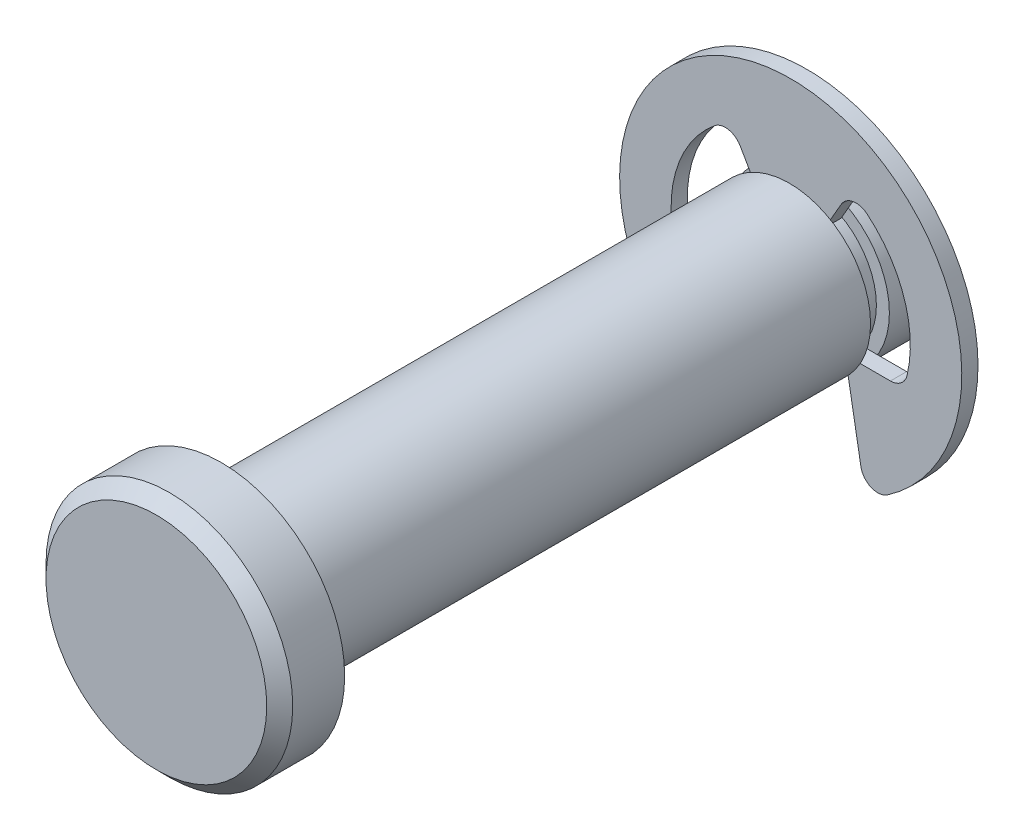
ISO-10303-21;
HEADER;
FILE_DESCRIPTION(('STEP AP214'),'2;1');
FILE_NAME('part.step','',(''),(''),'','','');
FILE_SCHEMA(('AUTOMOTIVE_DESIGN { 1 0 10303 214 1 1 1 1 }'));
ENDSEC;
DATA;
#1=APPLICATION_CONTEXT('core data for automotive mechanical design processes');
#2=APPLICATION_PROTOCOL_DEFINITION('international standard','automotive_design',2000,#1);
#3=PRODUCT_CONTEXT('',#1,'mechanical');
#4=PRODUCT('Part','Part','',(#3));
#5=PRODUCT_RELATED_PRODUCT_CATEGORY('part','',(#4));
#6=PRODUCT_DEFINITION_FORMATION('','',#4);
#7=PRODUCT_DEFINITION_CONTEXT('part definition',#1,'design');
#8=PRODUCT_DEFINITION('design','',#6,#7);
#9=PRODUCT_DEFINITION_SHAPE('','',#8);
#10=(LENGTH_UNIT() NAMED_UNIT(*) SI_UNIT(.MILLI.,.METRE.));
#11=(NAMED_UNIT(*) PLANE_ANGLE_UNIT() SI_UNIT($,.RADIAN.));
#12=(NAMED_UNIT(*) SI_UNIT($,.STERADIAN.) SOLID_ANGLE_UNIT());
#13=UNCERTAINTY_MEASURE_WITH_UNIT(LENGTH_MEASURE(1.E-05),#10,'distance_accuracy_value','');
#14=(GEOMETRIC_REPRESENTATION_CONTEXT(3) GLOBAL_UNCERTAINTY_ASSIGNED_CONTEXT((#13)) GLOBAL_UNIT_ASSIGNED_CONTEXT((#10,
#11,#12)) REPRESENTATION_CONTEXT('',''));
#15=CARTESIAN_POINT('',(0.,0.,0.));
#16=DIRECTION('',(0.,0.,1.));
#17=DIRECTION('',(1.,0.,0.));
#18=AXIS2_PLACEMENT_3D('',#15,#16,#17);
#19=CARTESIAN_POINT('',(0.,0.,-9.5758));
#20=DIRECTION('',(0.,0.,1.));
#21=DIRECTION('',(1.,0.,0.));
#22=AXIS2_PLACEMENT_3D('',#19,#20,#21);
#23=PLANE('',#22);
#24=DIRECTION('',(-0.173648177666931,0.984807753012208,0.));
#25=VECTOR('',#24,1.);
#26=CARTESIAN_POINT('',(1.79561377117954,0.316615154790629,-9.5758));
#27=LINE('',#26,#25);
#28=CARTESIAN_POINT('',(2.74784570227755,-5.08376048410501,-9.5758));
#29=VERTEX_POINT('',#28);
#30=CARTESIAN_POINT('',(2.1336,-1.6002,-9.5758));
#31=VERTEX_POINT('',#30);
#32=EDGE_CURVE('E204',#29,#31,#27,.T.);
#33=ORIENTED_EDGE('',*,*,#32,.F.);
#34=CARTESIAN_POINT('',(3.4069676832911,-4.96753949527431,-9.5758));
#35=DIRECTION('',(0.,0.,1.));
#36=DIRECTION('',(1.,0.,0.));
#37=AXIS2_PLACEMENT_3D('',#34,#35,#36);
#38=CIRCLE('',#37,0.66929);
#39=CARTESIAN_POINT('',(3.78551964810122,-5.51948832808256,-9.5758));
#40=VERTEX_POINT('',#39);
#41=EDGE_CURVE('E260',#29,#40,#38,.T.);
#42=ORIENTED_EDGE('',*,*,#41,.T.);
#43=CARTESIAN_POINT('',(0.,0.,-9.5758));
#44=DIRECTION('',(0.,0.,1.));
#45=DIRECTION('',(1.,0.,0.));
#46=AXIS2_PLACEMENT_3D('',#43,#44,#45);
#47=CIRCLE('',#46,6.6929);
#48=CARTESIAN_POINT('',(-3.78551964810122,-5.51948832808256,-9.5758));
#49=VERTEX_POINT('',#48);
#50=EDGE_CURVE('E184',#40,#49,#47,.T.);
#51=ORIENTED_EDGE('',*,*,#50,.T.);
#52=CARTESIAN_POINT('',(-3.4069676832911,-4.96753949527431,-9.5758));
#53=DIRECTION('',(0.,0.,1.));
#54=DIRECTION('',(1.,0.,0.));
#55=AXIS2_PLACEMENT_3D('',#52,#53,#54);
#56=CIRCLE('',#55,0.66929);
#57=CARTESIAN_POINT('',(-2.74784570227755,-5.08376048410501,-9.5758));
#58=VERTEX_POINT('',#57);
#59=EDGE_CURVE('E258',#49,#58,#56,.T.);
#60=ORIENTED_EDGE('',*,*,#59,.T.);
#61=DIRECTION('',(-0.173648177666931,-0.984807753012208,0.));
#62=VECTOR('',#61,1.);
#63=CARTESIAN_POINT('',(-1.79561377117954,0.316615154790629,-9.5758));
#64=LINE('',#63,#62);
#65=CARTESIAN_POINT('',(-2.1336,-1.6002,-9.5758));
#66=VERTEX_POINT('',#65);
#67=EDGE_CURVE('E200',#66,#58,#64,.T.);
#68=ORIENTED_EDGE('',*,*,#67,.F.);
#69=DIRECTION('',(1.,0.,0.));
#70=VECTOR('',#69,1.);
#71=CARTESIAN_POINT('',(0.,-1.6002,-9.5758));
#72=LINE('',#71,#70);
#73=CARTESIAN_POINT('',(-3.90112806858478,-1.6002,-9.5758));
#74=VERTEX_POINT('',#73);
#75=EDGE_CURVE('E191',#74,#66,#72,.T.);
#76=ORIENTED_EDGE('',*,*,#75,.F.);
#77=CARTESIAN_POINT('',(-3.90112806858478,-0.93091,-9.5758));
#78=DIRECTION('',(0.,0.,1.));
#79=DIRECTION('',(1.,0.,0.));
#80=AXIS2_PLACEMENT_3D('',#77,#78,#79);
#81=CIRCLE('',#80,0.66929);
#82=CARTESIAN_POINT('',(-4.55213962404525,-1.08625818556048,-9.5758));
#83=VERTEX_POINT('',#82);
#84=EDGE_CURVE('E56',#74,#83,#81,.F.);
#85=ORIENTED_EDGE('',*,*,#84,.T.);
#86=CARTESIAN_POINT('',(0.,0.,-9.5758));
#87=DIRECTION('',(0.,0.,1.));
#88=DIRECTION('',(1.,0.,0.));
#89=AXIS2_PLACEMENT_3D('',#86,#87,#88);
#90=CIRCLE('',#89,4.67995);
#91=CARTESIAN_POINT('',(-2.98351110662977,3.60563357527034,-9.5758));
#92=VERTEX_POINT('',#91);
#93=EDGE_CURVE('E216',#92,#83,#90,.T.);
#94=ORIENTED_EDGE('',*,*,#93,.F.);
#95=CARTESIAN_POINT('',(-2.55683258473184,3.08998394320319,-9.5758));
#96=DIRECTION('',(0.,0.,1.));
#97=DIRECTION('',(1.,0.,0.));
#98=AXIS2_PLACEMENT_3D('',#95,#96,#97);
#99=CIRCLE('',#98,0.66929);
#100=CARTESIAN_POINT('',(-1.97721044223295,3.42462894320319,-9.5758));
#101=VERTEX_POINT('',#100);
#102=EDGE_CURVE('E188',#92,#101,#99,.F.);
#103=ORIENTED_EDGE('',*,*,#102,.T.);
#104=DIRECTION('',(-0.500000000000001,0.866025403784438,0.));
#105=VECTOR('',#104,1.);
#106=CARTESIAN_POINT('',(0.,0.,-9.5758));
#107=LINE('',#106,#105);
#108=CARTESIAN_POINT('',(-1.3335,2.30968975189309,-9.5758));
#109=VERTEX_POINT('',#108);
#110=EDGE_CURVE('E180',#109,#101,#107,.T.);
#111=ORIENTED_EDGE('',*,*,#110,.F.);
#112=DIRECTION('',(1.,0.,0.));
#113=VECTOR('',#112,1.);
#114=CARTESIAN_POINT('',(-1.3335,2.30968975189309,-9.5758));
#115=LINE('',#114,#113);
#116=CARTESIAN_POINT('',(1.3335,2.30968975189309,-9.5758));
#117=VERTEX_POINT('',#116);
#118=EDGE_CURVE('E164',#109,#117,#115,.T.);
#119=ORIENTED_EDGE('',*,*,#118,.T.);
#120=DIRECTION('',(-0.500000000000001,-0.866025403784438,0.));
#121=VECTOR('',#120,1.);
#122=CARTESIAN_POINT('',(0.,0.,-9.5758));
#123=LINE('',#122,#121);
#124=CARTESIAN_POINT('',(1.97721044223295,3.42462894320319,-9.5758));
#125=VERTEX_POINT('',#124);
#126=EDGE_CURVE('E214',#125,#117,#123,.T.);
#127=ORIENTED_EDGE('',*,*,#126,.F.);
#128=CARTESIAN_POINT('',(2.55683258473184,3.08998394320319,-9.5758));
#129=DIRECTION('',(0.,0.,1.));
#130=DIRECTION('',(1.,0.,0.));
#131=AXIS2_PLACEMENT_3D('',#128,#129,#130);
#132=CIRCLE('',#131,0.66929);
#133=CARTESIAN_POINT('',(2.98351110662977,3.60563357527034,-9.5758));
#134=VERTEX_POINT('',#133);
#135=EDGE_CURVE('E275',#125,#134,#132,.F.);
#136=ORIENTED_EDGE('',*,*,#135,.T.);
#137=CARTESIAN_POINT('',(0.,0.,-9.5758));
#138=DIRECTION('',(0.,0.,1.));
#139=DIRECTION('',(1.,0.,0.));
#140=AXIS2_PLACEMENT_3D('',#137,#138,#139);
#141=CIRCLE('',#140,4.67995);
#142=CARTESIAN_POINT('',(4.55213962404525,-1.08625818556048,-9.5758));
#143=VERTEX_POINT('',#142);
#144=EDGE_CURVE('E219',#143,#134,#141,.T.);
#145=ORIENTED_EDGE('',*,*,#144,.F.);
#146=CARTESIAN_POINT('',(3.90112806858478,-0.93091,-9.5758));
#147=DIRECTION('',(0.,0.,1.));
#148=DIRECTION('',(1.,0.,0.));
#149=AXIS2_PLACEMENT_3D('',#146,#147,#148);
#150=CIRCLE('',#149,0.66929);
#151=CARTESIAN_POINT('',(3.90112806858478,-1.6002,-9.5758));
#152=VERTEX_POINT('',#151);
#153=EDGE_CURVE('E271',#143,#152,#150,.F.);
#154=ORIENTED_EDGE('',*,*,#153,.T.);
#155=DIRECTION('',(1.,0.,0.));
#156=VECTOR('',#155,1.);
#157=CARTESIAN_POINT('',(0.,-1.6002,-9.5758));
#158=LINE('',#157,#156);
#159=EDGE_CURVE('E209',#31,#152,#158,.T.);
#160=ORIENTED_EDGE('',*,*,#159,.F.);
#161=EDGE_LOOP('',(#33,#42,#51,#60,#68,#76,#85,#94,#103,#111,#119,#127,#136,#145,#154,#160));
#162=FACE_BOUND('',#161,.T.);
#163=ADVANCED_FACE('F48',(#162),#23,.T.);
#164=CARTESIAN_POINT('',(0.,0.,-10.2108));
#165=DIRECTION('',(0.,0.,1.));
#166=DIRECTION('',(1.,0.,0.));
#167=AXIS2_PLACEMENT_3D('',#164,#165,#166);
#168=PLANE('',#167);
#169=CARTESIAN_POINT('',(0.,0.,-10.2108));
#170=DIRECTION('',(0.,0.,1.));
#171=DIRECTION('',(1.,0.,0.));
#172=AXIS2_PLACEMENT_3D('',#169,#170,#171);
#173=CIRCLE('',#172,6.6929);
#174=CARTESIAN_POINT('',(3.78551964810122,-5.51948832808256,-10.2108));
#175=VERTEX_POINT('',#174);
#176=CARTESIAN_POINT('',(-3.78551964810122,-5.51948832808256,-10.2108));
#177=VERTEX_POINT('',#176);
#178=EDGE_CURVE('E222',#175,#177,#173,.T.);
#179=ORIENTED_EDGE('',*,*,#178,.F.);
#180=CARTESIAN_POINT('',(3.4069676832911,-4.96753949527431,-10.2108));
#181=DIRECTION('',(0.,0.,1.));
#182=DIRECTION('',(1.,0.,0.));
#183=AXIS2_PLACEMENT_3D('',#180,#181,#182);
#184=CIRCLE('',#183,0.66929);
#185=CARTESIAN_POINT('',(2.74784570227755,-5.08376048410501,-10.2108));
#186=VERTEX_POINT('',#185);
#187=EDGE_CURVE('E268',#175,#186,#184,.F.);
#188=ORIENTED_EDGE('',*,*,#187,.T.);
#189=DIRECTION('',(-0.173648177666931,0.984807753012208,0.));
#190=VECTOR('',#189,1.);
#191=CARTESIAN_POINT('',(1.79561377117954,0.316615154790629,-10.2108));
#192=LINE('',#191,#190);
#193=CARTESIAN_POINT('',(2.1336,-1.6002,-10.2108));
#194=VERTEX_POINT('',#193);
#195=EDGE_CURVE('E202',#186,#194,#192,.T.);
#196=ORIENTED_EDGE('',*,*,#195,.T.);
#197=DIRECTION('',(1.,0.,0.));
#198=VECTOR('',#197,1.);
#199=CARTESIAN_POINT('',(0.,-1.6002,-10.2108));
#200=LINE('',#199,#198);
#201=CARTESIAN_POINT('',(3.90112806858478,-1.6002,-10.2108));
#202=VERTEX_POINT('',#201);
#203=EDGE_CURVE('E206',#194,#202,#200,.T.);
#204=ORIENTED_EDGE('',*,*,#203,.T.);
#205=CARTESIAN_POINT('',(3.90112806858478,-0.93091,-10.2108));
#206=DIRECTION('',(0.,0.,1.));
#207=DIRECTION('',(1.,0.,0.));
#208=AXIS2_PLACEMENT_3D('',#205,#206,#207);
#209=CIRCLE('',#208,0.66929);
#210=CARTESIAN_POINT('',(4.55213962404525,-1.08625818556048,-10.2108));
#211=VERTEX_POINT('',#210);
#212=EDGE_CURVE('E273',#202,#211,#209,.T.);
#213=ORIENTED_EDGE('',*,*,#212,.T.);
#214=CARTESIAN_POINT('',(0.,0.,-10.2108));
#215=DIRECTION('',(0.,0.,1.));
#216=DIRECTION('',(1.,0.,0.));
#217=AXIS2_PLACEMENT_3D('',#214,#215,#216);
#218=CIRCLE('',#217,4.67995);
#219=CARTESIAN_POINT('',(2.98351110662977,3.60563357527034,-10.2108));
#220=VERTEX_POINT('',#219);
#221=EDGE_CURVE('E232',#211,#220,#218,.T.);
#222=ORIENTED_EDGE('',*,*,#221,.T.);
#223=CARTESIAN_POINT('',(2.55683258473184,3.08998394320319,-10.2108));
#224=DIRECTION('',(0.,0.,1.));
#225=DIRECTION('',(1.,0.,0.));
#226=AXIS2_PLACEMENT_3D('',#223,#224,#225);
#227=CIRCLE('',#226,0.66929);
#228=CARTESIAN_POINT('',(1.97721044223295,3.42462894320319,-10.2108));
#229=VERTEX_POINT('',#228);
#230=EDGE_CURVE('E277',#220,#229,#227,.T.);
#231=ORIENTED_EDGE('',*,*,#230,.T.);
#232=DIRECTION('',(-0.500000000000001,-0.866025403784438,0.));
#233=VECTOR('',#232,1.);
#234=CARTESIAN_POINT('',(0.,0.,-10.2108));
#235=LINE('',#234,#233);
#236=CARTESIAN_POINT('',(1.3335,2.30968975189309,-10.2108));
#237=VERTEX_POINT('',#236);
#238=EDGE_CURVE('E212',#229,#237,#235,.T.);
#239=ORIENTED_EDGE('',*,*,#238,.T.);
#240=DIRECTION('',(-1.,0.,0.));
#241=VECTOR('',#240,1.);
#242=CARTESIAN_POINT('',(-1.3335,2.30968975189309,-10.2108));
#243=LINE('',#242,#241);
#244=CARTESIAN_POINT('',(-1.3335,2.30968975189309,-10.2108));
#245=VERTEX_POINT('',#244);
#246=EDGE_CURVE('E175',#237,#245,#243,.T.);
#247=ORIENTED_EDGE('',*,*,#246,.T.);
#248=DIRECTION('',(-0.500000000000001,0.866025403784438,0.));
#249=VECTOR('',#248,1.);
#250=CARTESIAN_POINT('',(0.,0.,-10.2108));
#251=LINE('',#250,#249);
#252=CARTESIAN_POINT('',(-1.97721044223295,3.42462894320319,-10.2108));
#253=VERTEX_POINT('',#252);
#254=EDGE_CURVE('E183',#245,#253,#251,.T.);
#255=ORIENTED_EDGE('',*,*,#254,.T.);
#256=CARTESIAN_POINT('',(-2.55683258473184,3.08998394320319,-10.2108));
#257=DIRECTION('',(0.,0.,1.));
#258=DIRECTION('',(1.,0.,0.));
#259=AXIS2_PLACEMENT_3D('',#256,#257,#258);
#260=CIRCLE('',#259,0.66929);
#261=CARTESIAN_POINT('',(-2.98351110662977,3.60563357527034,-10.2108));
#262=VERTEX_POINT('',#261);
#263=EDGE_CURVE('E280',#253,#262,#260,.T.);
#264=ORIENTED_EDGE('',*,*,#263,.T.);
#265=CARTESIAN_POINT('',(0.,0.,-10.2108));
#266=DIRECTION('',(0.,0.,1.));
#267=DIRECTION('',(1.,0.,0.));
#268=AXIS2_PLACEMENT_3D('',#265,#266,#267);
#269=CIRCLE('',#268,4.67995);
#270=CARTESIAN_POINT('',(-4.55213962404525,-1.08625818556048,-10.2108));
#271=VERTEX_POINT('',#270);
#272=EDGE_CURVE('E229',#262,#271,#269,.T.);
#273=ORIENTED_EDGE('',*,*,#272,.T.);
#274=CARTESIAN_POINT('',(-3.90112806858478,-0.93091,-10.2108));
#275=DIRECTION('',(0.,0.,1.));
#276=DIRECTION('',(1.,0.,0.));
#277=AXIS2_PLACEMENT_3D('',#274,#275,#276);
#278=CIRCLE('',#277,0.66929);
#279=CARTESIAN_POINT('',(-3.90112806858478,-1.6002,-10.2108));
#280=VERTEX_POINT('',#279);
#281=EDGE_CURVE('E13',#271,#280,#278,.T.);
#282=ORIENTED_EDGE('',*,*,#281,.T.);
#283=DIRECTION('',(1.,0.,0.));
#284=VECTOR('',#283,1.);
#285=CARTESIAN_POINT('',(0.,-1.6002,-10.2108));
#286=LINE('',#285,#284);
#287=CARTESIAN_POINT('',(-2.1336,-1.6002,-10.2108));
#288=VERTEX_POINT('',#287);
#289=EDGE_CURVE('E189',#280,#288,#286,.T.);
#290=ORIENTED_EDGE('',*,*,#289,.T.);
#291=DIRECTION('',(-0.173648177666931,-0.984807753012208,0.));
#292=VECTOR('',#291,1.);
#293=CARTESIAN_POINT('',(-1.79561377117954,0.316615154790629,-10.2108));
#294=LINE('',#293,#292);
#295=CARTESIAN_POINT('',(-2.74784570227755,-5.08376048410501,-10.2108));
#296=VERTEX_POINT('',#295);
#297=EDGE_CURVE('E198',#288,#296,#294,.T.);
#298=ORIENTED_EDGE('',*,*,#297,.T.);
#299=CARTESIAN_POINT('',(-3.4069676832911,-4.96753949527431,-10.2108));
#300=DIRECTION('',(0.,0.,1.));
#301=DIRECTION('',(1.,0.,0.));
#302=AXIS2_PLACEMENT_3D('',#299,#300,#301);
#303=CIRCLE('',#302,0.66929);
#304=EDGE_CURVE('E70',#296,#177,#303,.F.);
#305=ORIENTED_EDGE('',*,*,#304,.T.);
#306=EDGE_LOOP('',(#179,#188,#196,#204,#213,#222,#231,#239,#247,#255,#264,#273,#282,#290,#298,#305));
#307=FACE_BOUND('',#306,.T.);
#308=ADVANCED_FACE('F293',(#307),#168,.F.);
#309=CARTESIAN_POINT('',(0.,0.,-9.5758));
#310=DIRECTION('',(0.,0.,-1.));
#311=DIRECTION('',(-1.,0.,0.));
#312=AXIS2_PLACEMENT_3D('',#309,#310,#311);
#313=CYLINDRICAL_SURFACE('',#312,6.6929);
#314=ORIENTED_EDGE('',*,*,#50,.F.);
#315=DIRECTION('',(0.,0.,-1.));
#316=VECTOR('',#315,1.);
#317=CARTESIAN_POINT('',(3.78551964810122,-5.51948832808256,-9.5758));
#318=LINE('',#317,#316);
#319=EDGE_CURVE('E265',#40,#175,#318,.T.);
#320=ORIENTED_EDGE('',*,*,#319,.T.);
#321=ORIENTED_EDGE('',*,*,#178,.T.);
#322=DIRECTION('',(0.,0.,-1.));
#323=VECTOR('',#322,1.);
#324=CARTESIAN_POINT('',(-3.78551964810122,-5.51948832808256,-9.5758));
#325=LINE('',#324,#323);
#326=EDGE_CURVE('E262',#177,#49,#325,.F.);
#327=ORIENTED_EDGE('',*,*,#326,.T.);
#328=EDGE_LOOP('',(#314,#320,#321,#327));
#329=FACE_BOUND('',#328,.T.);
#330=ADVANCED_FACE('F333',(#329),#313,.T.);
#331=CARTESIAN_POINT('',(-2.1336,-1.6002,-12.7));
#332=DIRECTION('',(-0.984807753012208,0.173648177666931,0.));
#333=DIRECTION('',(-0.173648177666931,-0.984807753012208,0.));
#334=AXIS2_PLACEMENT_3D('',#331,#332,#333);
#335=PLANE('',#334);
#336=ORIENTED_EDGE('',*,*,#67,.T.);
#337=DIRECTION('',(0.,0.,-1.));
#338=VECTOR('',#337,1.);
#339=CARTESIAN_POINT('',(-2.74784570227755,-5.08376048410501,-12.7));
#340=LINE('',#339,#338);
#341=EDGE_CURVE('E63',#58,#296,#340,.T.);
#342=ORIENTED_EDGE('',*,*,#341,.T.);
#343=ORIENTED_EDGE('',*,*,#297,.F.);
#344=DIRECTION('',(0.,0.,1.));
#345=VECTOR('',#344,1.);
#346=CARTESIAN_POINT('',(-2.1336,-1.6002,-12.7));
#347=LINE('',#346,#345);
#348=EDGE_CURVE('E298',#288,#66,#347,.T.);
#349=ORIENTED_EDGE('',*,*,#348,.T.);
#350=EDGE_LOOP('',(#336,#342,#343,#349));
#351=FACE_BOUND('',#350,.T.);
#352=ADVANCED_FACE('F338',(#351),#335,.F.);
#353=CARTESIAN_POINT('',(-2.33997500000001,4.05295558844098,-12.7));
#354=DIRECTION('',(0.866025403784438,0.500000000000001,0.));
#355=DIRECTION('',(-0.500000000000001,0.866025403784438,0.));
#356=AXIS2_PLACEMENT_3D('',#353,#354,#355);
#357=PLANE('',#356);
#358=ORIENTED_EDGE('',*,*,#110,.T.);
#359=DIRECTION('',(0.,0.,-1.));
#360=VECTOR('',#359,1.);
#361=CARTESIAN_POINT('',(-1.97721044223295,3.42462894320319,-10.2108));
#362=LINE('',#361,#360);
#363=EDGE_CURVE('E250',#101,#253,#362,.T.);
#364=ORIENTED_EDGE('',*,*,#363,.T.);
#365=ORIENTED_EDGE('',*,*,#254,.F.);
#366=DIRECTION('',(0.,0.,-1.));
#367=VECTOR('',#366,1.);
#368=CARTESIAN_POINT('',(-1.3335,2.30968975189309,-9.5758));
#369=LINE('',#368,#367);
#370=EDGE_CURVE('E168',#245,#109,#369,.F.);
#371=ORIENTED_EDGE('',*,*,#370,.T.);
#372=EDGE_LOOP('',(#358,#364,#365,#371));
#373=FACE_BOUND('',#372,.T.);
#374=ADVANCED_FACE('F179',(#373),#357,.F.);
#375=CARTESIAN_POINT('',(0.,0.,-12.7));
#376=DIRECTION('',(0.,0.,1.));
#377=DIRECTION('',(1.,0.,0.));
#378=AXIS2_PLACEMENT_3D('',#375,#376,#377);
#379=CYLINDRICAL_SURFACE('',#378,4.67995);
#380=ORIENTED_EDGE('',*,*,#272,.F.);
#381=DIRECTION('',(0.,0.,1.));
#382=VECTOR('',#381,1.);
#383=CARTESIAN_POINT('',(-2.98351110662977,3.60563357527034,-12.7));
#384=LINE('',#383,#382);
#385=EDGE_CURVE('E247',#262,#92,#384,.T.);
#386=ORIENTED_EDGE('',*,*,#385,.T.);
#387=ORIENTED_EDGE('',*,*,#93,.T.);
#388=DIRECTION('',(0.,0.,1.));
#389=VECTOR('',#388,1.);
#390=CARTESIAN_POINT('',(-4.55213962404525,-1.08625818556048,-12.7));
#391=LINE('',#390,#389);
#392=EDGE_CURVE('E245',#83,#271,#391,.F.);
#393=ORIENTED_EDGE('',*,*,#392,.T.);
#394=EDGE_LOOP('',(#380,#386,#387,#393));
#395=FACE_BOUND('',#394,.T.);
#396=ADVANCED_FACE('F288',(#395),#379,.F.);
#397=CARTESIAN_POINT('',(-4.39787357281903,-1.6002,-12.7));
#398=DIRECTION('',(0.,-1.,0.));
#399=DIRECTION('',(0.,0.,-1.));
#400=AXIS2_PLACEMENT_3D('',#397,#398,#399);
#401=PLANE('',#400);
#402=ORIENTED_EDGE('',*,*,#289,.F.);
#403=DIRECTION('',(0.,0.,-1.));
#404=VECTOR('',#403,1.);
#405=CARTESIAN_POINT('',(-3.90112806858478,-1.6002,-9.5758));
#406=LINE('',#405,#404);
#407=EDGE_CURVE('E252',#280,#74,#406,.F.);
#408=ORIENTED_EDGE('',*,*,#407,.T.);
#409=ORIENTED_EDGE('',*,*,#75,.T.);
#410=ORIENTED_EDGE('',*,*,#348,.F.);
#411=EDGE_LOOP('',(#402,#408,#409,#410));
#412=FACE_BOUND('',#411,.T.);
#413=ADVANCED_FACE('F296',(#412),#401,.F.);
#414=CARTESIAN_POINT('',(0.,0.,-12.7));
#415=DIRECTION('',(0.,0.,1.));
#416=DIRECTION('',(1.,0.,0.));
#417=AXIS2_PLACEMENT_3D('',#414,#415,#416);
#418=CYLINDRICAL_SURFACE('',#417,4.67995);
#419=ORIENTED_EDGE('',*,*,#221,.F.);
#420=DIRECTION('',(0.,0.,1.));
#421=VECTOR('',#420,1.);
#422=CARTESIAN_POINT('',(4.55213962404525,-1.08625818556048,-12.7));
#423=LINE('',#422,#421);
#424=EDGE_CURVE('E237',#211,#143,#423,.T.);
#425=ORIENTED_EDGE('',*,*,#424,.T.);
#426=ORIENTED_EDGE('',*,*,#144,.T.);
#427=DIRECTION('',(0.,0.,1.));
#428=VECTOR('',#427,1.);
#429=CARTESIAN_POINT('',(2.98351110662977,3.60563357527034,-12.7));
#430=LINE('',#429,#428);
#431=EDGE_CURVE('E235',#134,#220,#430,.F.);
#432=ORIENTED_EDGE('',*,*,#431,.T.);
#433=EDGE_LOOP('',(#419,#425,#426,#432));
#434=FACE_BOUND('',#433,.T.);
#435=ADVANCED_FACE('F312',(#434),#418,.F.);
#436=CARTESIAN_POINT('',(2.1336,-1.6002,-12.7));
#437=DIRECTION('',(0.,-1.,0.));
#438=DIRECTION('',(0.,0.,-1.));
#439=AXIS2_PLACEMENT_3D('',#436,#437,#438);
#440=PLANE('',#439);
#441=ORIENTED_EDGE('',*,*,#159,.T.);
#442=DIRECTION('',(0.,0.,-1.));
#443=VECTOR('',#442,1.);
#444=CARTESIAN_POINT('',(3.90112806858478,-1.6002,-10.2108));
#445=LINE('',#444,#443);
#446=EDGE_CURVE('E240',#152,#202,#445,.T.);
#447=ORIENTED_EDGE('',*,*,#446,.T.);
#448=ORIENTED_EDGE('',*,*,#203,.F.);
#449=DIRECTION('',(0.,0.,1.));
#450=VECTOR('',#449,1.);
#451=CARTESIAN_POINT('',(2.1336,-1.6002,-12.7));
#452=LINE('',#451,#450);
#453=EDGE_CURVE('E193',#194,#31,#452,.T.);
#454=ORIENTED_EDGE('',*,*,#453,.T.);
#455=EDGE_LOOP('',(#441,#447,#448,#454));
#456=FACE_BOUND('',#455,.T.);
#457=ADVANCED_FACE('F322',(#456),#440,.F.);
#458=CARTESIAN_POINT('',(2.1336,-1.6002,-12.7));
#459=DIRECTION('',(0.984807753012208,0.173648177666931,0.));
#460=DIRECTION('',(-0.173648177666931,0.984807753012208,0.));
#461=AXIS2_PLACEMENT_3D('',#458,#459,#460);
#462=PLANE('',#461);
#463=ORIENTED_EDGE('',*,*,#195,.F.);
#464=DIRECTION('',(0.,0.,-1.));
#465=VECTOR('',#464,1.);
#466=CARTESIAN_POINT('',(2.74784570227755,-5.08376048410501,-12.7));
#467=LINE('',#466,#465);
#468=EDGE_CURVE('E255',#186,#29,#467,.F.);
#469=ORIENTED_EDGE('',*,*,#468,.T.);
#470=ORIENTED_EDGE('',*,*,#32,.T.);
#471=ORIENTED_EDGE('',*,*,#453,.F.);
#472=EDGE_LOOP('',(#463,#469,#470,#471));
#473=FACE_BOUND('',#472,.T.);
#474=ADVANCED_FACE('F327',(#473),#462,.F.);
#475=CARTESIAN_POINT('',(0.,0.,-12.7));
#476=DIRECTION('',(-0.866025403784438,0.500000000000001,0.));
#477=DIRECTION('',(-0.500000000000001,-0.866025403784438,0.));
#478=AXIS2_PLACEMENT_3D('',#475,#476,#477);
#479=PLANE('',#478);
#480=ORIENTED_EDGE('',*,*,#238,.F.);
#481=DIRECTION('',(0.,0.,-1.));
#482=VECTOR('',#481,1.);
#483=CARTESIAN_POINT('',(1.97721044223295,3.42462894320319,-9.5758));
#484=LINE('',#483,#482);
#485=EDGE_CURVE('E242',#229,#125,#484,.F.);
#486=ORIENTED_EDGE('',*,*,#485,.T.);
#487=ORIENTED_EDGE('',*,*,#126,.T.);
#488=DIRECTION('',(0.,0.,-1.));
#489=VECTOR('',#488,1.);
#490=CARTESIAN_POINT('',(1.3335,2.30968975189309,-9.5758));
#491=LINE('',#490,#489);
#492=EDGE_CURVE('E171',#117,#237,#491,.T.);
#493=ORIENTED_EDGE('',*,*,#492,.T.);
#494=EDGE_LOOP('',(#480,#486,#487,#493));
#495=FACE_BOUND('',#494,.T.);
#496=ADVANCED_FACE('F305',(#495),#479,.F.);
#497=CARTESIAN_POINT('',(-1.3335,2.30968975189309,-12.9016287967469));
#498=DIRECTION('',(0.,-1.,0.));
#499=DIRECTION('',(0.,0.,-1.));
#500=AXIS2_PLACEMENT_3D('',#497,#498,#499);
#501=PLANE('',#500);
#502=ORIENTED_EDGE('',*,*,#246,.F.);
#503=ORIENTED_EDGE('',*,*,#492,.F.);
#504=ORIENTED_EDGE('',*,*,#118,.F.);
#505=ORIENTED_EDGE('',*,*,#370,.F.);
#506=EDGE_LOOP('',(#502,#503,#504,#505));
#507=FACE_BOUND('',#506,.T.);
#508=ADVANCED_FACE('F167',(#507),#501,.T.);
#509=CARTESIAN_POINT('',(3.90112806858478,-0.93091,-12.7));
#510=DIRECTION('',(0.,0.,1.));
#511=DIRECTION('',(1.,0.,0.));
#512=AXIS2_PLACEMENT_3D('',#509,#510,#511);
#513=CYLINDRICAL_SURFACE('',#512,0.66929);
#514=ORIENTED_EDGE('',*,*,#212,.F.);
#515=ORIENTED_EDGE('',*,*,#446,.F.);
#516=ORIENTED_EDGE('',*,*,#153,.F.);
#517=ORIENTED_EDGE('',*,*,#424,.F.);
#518=EDGE_LOOP('',(#514,#515,#516,#517));
#519=FACE_BOUND('',#518,.T.);
#520=ADVANCED_FACE('F318',(#519),#513,.F.);
#521=CARTESIAN_POINT('',(2.55683258473184,3.08998394320319,-12.7));
#522=DIRECTION('',(0.,0.,1.));
#523=DIRECTION('',(1.,0.,0.));
#524=AXIS2_PLACEMENT_3D('',#521,#522,#523);
#525=CYLINDRICAL_SURFACE('',#524,0.66929);
#526=ORIENTED_EDGE('',*,*,#230,.F.);
#527=ORIENTED_EDGE('',*,*,#431,.F.);
#528=ORIENTED_EDGE('',*,*,#135,.F.);
#529=ORIENTED_EDGE('',*,*,#485,.F.);
#530=EDGE_LOOP('',(#526,#527,#528,#529));
#531=FACE_BOUND('',#530,.T.);
#532=ADVANCED_FACE('F315',(#531),#525,.F.);
#533=CARTESIAN_POINT('',(-2.55683258473184,3.08998394320319,-12.7));
#534=DIRECTION('',(0.,0.,1.));
#535=DIRECTION('',(1.,0.,0.));
#536=AXIS2_PLACEMENT_3D('',#533,#534,#535);
#537=CYLINDRICAL_SURFACE('',#536,0.66929);
#538=ORIENTED_EDGE('',*,*,#263,.F.);
#539=ORIENTED_EDGE('',*,*,#363,.F.);
#540=ORIENTED_EDGE('',*,*,#102,.F.);
#541=ORIENTED_EDGE('',*,*,#385,.F.);
#542=EDGE_LOOP('',(#538,#539,#540,#541));
#543=FACE_BOUND('',#542,.T.);
#544=ADVANCED_FACE('F361',(#543),#537,.F.);
#545=CARTESIAN_POINT('',(-3.90112806858478,-0.93091,-12.7));
#546=DIRECTION('',(0.,0.,1.));
#547=DIRECTION('',(1.,0.,0.));
#548=AXIS2_PLACEMENT_3D('',#545,#546,#547);
#549=CYLINDRICAL_SURFACE('',#548,0.66929);
#550=ORIENTED_EDGE('',*,*,#281,.F.);
#551=ORIENTED_EDGE('',*,*,#392,.F.);
#552=ORIENTED_EDGE('',*,*,#84,.F.);
#553=ORIENTED_EDGE('',*,*,#407,.F.);
#554=EDGE_LOOP('',(#550,#551,#552,#553));
#555=FACE_BOUND('',#554,.T.);
#556=ADVANCED_FACE('F291',(#555),#549,.F.);
#557=CARTESIAN_POINT('',(3.4069676832911,-4.96753949527431,-9.5758));
#558=DIRECTION('',(0.,0.,-1.));
#559=DIRECTION('',(-1.,0.,0.));
#560=AXIS2_PLACEMENT_3D('',#557,#558,#559);
#561=CYLINDRICAL_SURFACE('',#560,0.66929);
#562=ORIENTED_EDGE('',*,*,#187,.F.);
#563=ORIENTED_EDGE('',*,*,#319,.F.);
#564=ORIENTED_EDGE('',*,*,#41,.F.);
#565=ORIENTED_EDGE('',*,*,#468,.F.);
#566=EDGE_LOOP('',(#562,#563,#564,#565));
#567=FACE_BOUND('',#566,.T.);
#568=ADVANCED_FACE('F336',(#567),#561,.T.);
#569=CARTESIAN_POINT('',(-3.4069676832911,-4.96753949527431,-9.5758));
#570=DIRECTION('',(0.,0.,-1.));
#571=DIRECTION('',(-1.,0.,0.));
#572=AXIS2_PLACEMENT_3D('',#569,#570,#571);
#573=CYLINDRICAL_SURFACE('',#572,0.66929);
#574=ORIENTED_EDGE('',*,*,#304,.F.);
#575=ORIENTED_EDGE('',*,*,#341,.F.);
#576=ORIENTED_EDGE('',*,*,#59,.F.);
#577=ORIENTED_EDGE('',*,*,#326,.F.);
#578=EDGE_LOOP('',(#574,#575,#576,#577));
#579=FACE_BOUND('',#578,.T.);
#580=ADVANCED_FACE('F50',(#579),#573,.T.);
#581=CLOSED_SHELL('',(#163,#308,#330,#352,#374,#396,#413,#435,#457,#474,#496,#508,#520,#532,
#544,#556,#568,#580));
#582=MANIFOLD_SOLID_BREP('B2',#581);
#583=CARTESIAN_POINT('',(0.,0.,12.7));
#584=DIRECTION('',(0.,0.,-1.));
#585=DIRECTION('',(-1.,0.,0.));
#586=AXIS2_PLACEMENT_3D('',#583,#584,#585);
#587=CYLINDRICAL_SURFACE('',#586,3.175);
#588=CARTESIAN_POINT('',(0.,0.,12.7));
#589=DIRECTION('',(0.,0.,1.));
#590=DIRECTION('',(1.,0.,0.));
#591=AXIS2_PLACEMENT_3D('',#588,#589,#590);
#592=CIRCLE('',#591,3.175);
#593=CARTESIAN_POINT('',(3.175,0.,12.7));
#594=VERTEX_POINT('',#593);
#595=EDGE_CURVE('E514',#594,#594,#592,.T.);
#596=ORIENTED_EDGE('',*,*,#595,.F.);
#597=EDGE_LOOP('',(#596));
#598=FACE_BOUND('',#597,.T.);
#599=CARTESIAN_POINT('',(0.,0.,-9.525));
#600=DIRECTION('',(0.,0.,1.));
#601=DIRECTION('',(1.,0.,0.));
#602=AXIS2_PLACEMENT_3D('',#599,#600,#601);
#603=CIRCLE('',#602,3.175);
#604=CARTESIAN_POINT('',(3.175,0.,-9.525));
#605=VERTEX_POINT('',#604);
#606=EDGE_CURVE('E526',#605,#605,#603,.T.);
#607=ORIENTED_EDGE('',*,*,#606,.T.);
#608=EDGE_LOOP('',(#607));
#609=FACE_BOUND('',#608,.T.);
#610=ADVANCED_FACE('F493',(#598,#609),#587,.T.);
#611=CARTESIAN_POINT('',(0.,3.175,-9.525));
#612=DIRECTION('',(0.,0.,-1.));
#613=DIRECTION('',(-1.,0.,0.));
#614=AXIS2_PLACEMENT_3D('',#611,#612,#613);
#615=PLANE('',#614);
#616=CARTESIAN_POINT('',(0.,0.,-9.525));
#617=DIRECTION('',(0.,0.,1.));
#618=DIRECTION('',(1.,0.,0.));
#619=AXIS2_PLACEMENT_3D('',#616,#617,#618);
#620=CIRCLE('',#619,2.667);
#621=CARTESIAN_POINT('',(2.667,0.,-9.525));
#622=VERTEX_POINT('',#621);
#623=EDGE_CURVE('E517',#622,#622,#620,.T.);
#624=ORIENTED_EDGE('',*,*,#623,.T.);
#625=EDGE_LOOP('',(#624));
#626=FACE_BOUND('',#625,.T.);
#627=ORIENTED_EDGE('',*,*,#606,.F.);
#628=EDGE_LOOP('',(#627));
#629=FACE_BOUND('',#628,.T.);
#630=ADVANCED_FACE('F545',(#626,#629),#615,.T.);
#631=CARTESIAN_POINT('',(0.,0.,12.7));
#632=DIRECTION('',(0.,0.,1.));
#633=DIRECTION('',(1.,0.,0.));
#634=AXIS2_PLACEMENT_3D('',#631,#632,#633);
#635=CYLINDRICAL_SURFACE('',#634,2.667);
#636=CARTESIAN_POINT('',(0.,0.,-10.2616));
#637=DIRECTION('',(0.,0.,1.));
#638=DIRECTION('',(1.,0.,0.));
#639=AXIS2_PLACEMENT_3D('',#636,#637,#638);
#640=CIRCLE('',#639,2.667);
#641=CARTESIAN_POINT('',(2.667,0.,-10.2616));
#642=VERTEX_POINT('',#641);
#643=EDGE_CURVE('E520',#642,#642,#640,.T.);
#644=ORIENTED_EDGE('',*,*,#643,.T.);
#645=EDGE_LOOP('',(#644));
#646=FACE_BOUND('',#645,.T.);
#647=ORIENTED_EDGE('',*,*,#623,.F.);
#648=EDGE_LOOP('',(#647));
#649=FACE_BOUND('',#648,.T.);
#650=ADVANCED_FACE('F550',(#646,#649),#635,.T.);
#651=CARTESIAN_POINT('',(0.,3.175,-10.2616));
#652=DIRECTION('',(0.,0.,1.));
#653=DIRECTION('',(1.,0.,0.));
#654=AXIS2_PLACEMENT_3D('',#651,#652,#653);
#655=PLANE('',#654);
#656=CARTESIAN_POINT('',(0.,0.,-10.2616));
#657=DIRECTION('',(0.,0.,1.));
#658=DIRECTION('',(1.,0.,0.));
#659=AXIS2_PLACEMENT_3D('',#656,#657,#658);
#660=CIRCLE('',#659,3.175);
#661=CARTESIAN_POINT('',(3.175,0.,-10.2616));
#662=VERTEX_POINT('',#661);
#663=EDGE_CURVE('E523',#662,#662,#660,.T.);
#664=ORIENTED_EDGE('',*,*,#663,.T.);
#665=EDGE_LOOP('',(#664));
#666=FACE_BOUND('',#665,.T.);
#667=ORIENTED_EDGE('',*,*,#643,.F.);
#668=EDGE_LOOP('',(#667));
#669=FACE_BOUND('',#668,.T.);
#670=ADVANCED_FACE('F556',(#666,#669),#655,.T.);
#671=CARTESIAN_POINT('',(0.,0.,-12.7));
#672=DIRECTION('',(0.,0.,1.));
#673=DIRECTION('',(1.,0.,0.));
#674=AXIS2_PLACEMENT_3D('',#671,#672,#673);
#675=PLANE('',#674);
#676=CARTESIAN_POINT('',(0.,0.,-12.7));
#677=DIRECTION('',(0.,0.,1.));
#678=DIRECTION('',(1.,0.,0.));
#679=AXIS2_PLACEMENT_3D('',#676,#677,#678);
#680=CIRCLE('',#679,2.54000000000001);
#681=CARTESIAN_POINT('',(2.54000000000001,0.,-12.7));
#682=VERTEX_POINT('',#681);
#683=EDGE_CURVE('E47',#682,#682,#680,.F.);
#684=ORIENTED_EDGE('',*,*,#683,.T.);
#685=EDGE_LOOP('',(#684));
#686=FACE_BOUND('',#685,.T.);
#687=ADVANCED_FACE('F561',(#686),#675,.F.);
#688=CARTESIAN_POINT('',(0.,0.,-12.065));
#689=DIRECTION('',(0.,0.,1.));
#690=DIRECTION('',(1.,0.,0.));
#691=AXIS2_PLACEMENT_3D('',#688,#689,#690);
#692=CIRCLE('',#691,3.175);
#693=CARTESIAN_POINT('',(3.175,0.,-12.065));
#694=VERTEX_POINT('',#693);
#695=EDGE_CURVE('E500',#694,#694,#692,.T.);
#696=ORIENTED_EDGE('',*,*,#695,.T.);
#697=EDGE_LOOP('',(#696));
#698=FACE_BOUND('',#697,.T.);
#699=ORIENTED_EDGE('',*,*,#663,.F.);
#700=EDGE_LOOP('',(#699));
#701=FACE_BOUND('',#700,.T.);
#702=ADVANCED_FACE('F539',(#698,#701),#587,.T.);
#703=CARTESIAN_POINT('',(0.,0.,12.7));
#704=DIRECTION('',(0.,0.,1.));
#705=DIRECTION('',(1.,0.,0.));
#706=AXIS2_PLACEMENT_3D('',#703,#704,#705);
#707=PLANE('',#706);
#708=CARTESIAN_POINT('',(0.,0.,12.7));
#709=DIRECTION('',(0.,0.,1.));
#710=DIRECTION('',(1.,0.,0.));
#711=AXIS2_PLACEMENT_3D('',#708,#709,#710);
#712=CIRCLE('',#711,4.826);
#713=CARTESIAN_POINT('',(4.826,0.,12.7));
#714=VERTEX_POINT('',#713);
#715=EDGE_CURVE('E529',#714,#714,#712,.T.);
#716=ORIENTED_EDGE('',*,*,#715,.F.);
#717=EDGE_LOOP('',(#716));
#718=FACE_BOUND('',#717,.T.);
#719=ORIENTED_EDGE('',*,*,#595,.T.);
#720=EDGE_LOOP('',(#719));
#721=FACE_BOUND('',#720,.T.);
#722=ADVANCED_FACE('F536',(#718,#721),#707,.F.);
#723=CARTESIAN_POINT('',(0.,0.,15.24));
#724=DIRECTION('',(0.,0.,-1.));
#725=DIRECTION('',(-1.,0.,0.));
#726=AXIS2_PLACEMENT_3D('',#723,#724,#725);
#727=CYLINDRICAL_SURFACE('',#726,4.826);
#728=CARTESIAN_POINT('',(0.,0.,14.732));
#729=DIRECTION('',(0.,0.,1.));
#730=DIRECTION('',(1.,0.,0.));
#731=AXIS2_PLACEMENT_3D('',#728,#729,#730);
#732=CIRCLE('',#731,4.826);
#733=CARTESIAN_POINT('',(4.826,0.,14.732));
#734=VERTEX_POINT('',#733);
#735=EDGE_CURVE('E504',#734,#734,#732,.F.);
#736=ORIENTED_EDGE('',*,*,#735,.T.);
#737=EDGE_LOOP('',(#736));
#738=FACE_BOUND('',#737,.T.);
#739=ORIENTED_EDGE('',*,*,#715,.T.);
#740=EDGE_LOOP('',(#739));
#741=FACE_BOUND('',#740,.T.);
#742=ADVANCED_FACE('F534',(#738,#741),#727,.T.);
#743=CARTESIAN_POINT('',(0.,0.,15.24));
#744=DIRECTION('',(0.,0.,1.));
#745=DIRECTION('',(1.,0.,0.));
#746=AXIS2_PLACEMENT_3D('',#743,#744,#745);
#747=PLANE('',#746);
#748=CARTESIAN_POINT('',(0.,0.,15.24));
#749=DIRECTION('',(0.,0.,1.));
#750=DIRECTION('',(1.,0.,0.));
#751=AXIS2_PLACEMENT_3D('',#748,#749,#750);
#752=CIRCLE('',#751,4.31799999999999);
#753=CARTESIAN_POINT('',(4.31799999999999,0.,15.24));
#754=VERTEX_POINT('',#753);
#755=EDGE_CURVE('E509',#754,#754,#752,.T.);
#756=ORIENTED_EDGE('',*,*,#755,.T.);
#757=EDGE_LOOP('',(#756));
#758=FACE_BOUND('',#757,.T.);
#759=ADVANCED_FACE('F565',(#758),#747,.T.);
#760=CARTESIAN_POINT('',(0.,0.,15.24));
#761=DIRECTION('',(0.,0.,-1.));
#762=DIRECTION('',(-1.,0.,0.));
#763=AXIS2_PLACEMENT_3D('',#760,#761,#762);
#764=CONICAL_SURFACE('',#763,4.31799999999999,0.785398163397444);
#765=ORIENTED_EDGE('',*,*,#735,.F.);
#766=EDGE_LOOP('',(#765));
#767=FACE_BOUND('',#766,.T.);
#768=ORIENTED_EDGE('',*,*,#755,.F.);
#769=EDGE_LOOP('',(#768));
#770=FACE_BOUND('',#769,.T.);
#771=ADVANCED_FACE('F563',(#767,#770),#764,.T.);
#772=CARTESIAN_POINT('',(0.,0.,-12.065));
#773=DIRECTION('',(0.,0.,1.));
#774=DIRECTION('',(1.,0.,0.));
#775=AXIS2_PLACEMENT_3D('',#772,#773,#774);
#776=CONICAL_SURFACE('',#775,3.175,0.785398163397447);
#777=ORIENTED_EDGE('',*,*,#683,.F.);
#778=EDGE_LOOP('',(#777));
#779=FACE_BOUND('',#778,.T.);
#780=ORIENTED_EDGE('',*,*,#695,.F.);
#781=EDGE_LOOP('',(#780));
#782=FACE_BOUND('',#781,.T.);
#783=ADVANCED_FACE('F495',(#779,#782),#776,.T.);
#784=CLOSED_SHELL('',(#610,#630,#650,#670,#687,#702,#722,#742,#759,#771,#783));
#785=MANIFOLD_SOLID_BREP('B7',#784);
#786=ADVANCED_BREP_SHAPE_REPRESENTATION('',(#18,#582,#785),#14);
#787=SHAPE_DEFINITION_REPRESENTATION(#9,#786);
ENDSEC;
END-ISO-10303-21;
